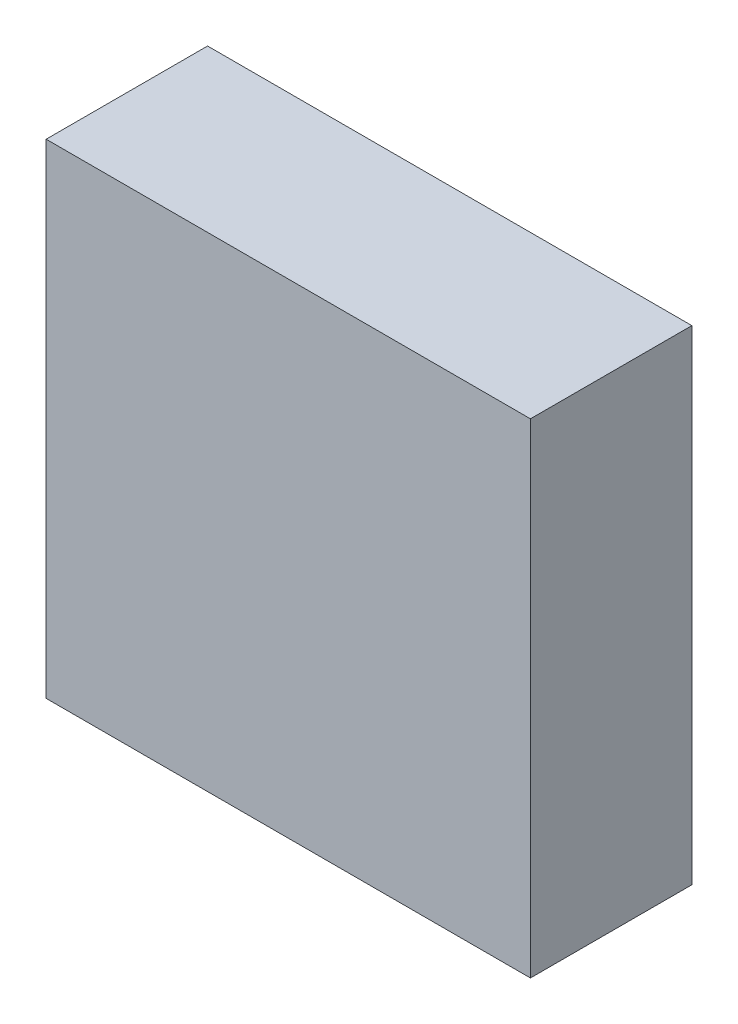
ISO-10303-21;
HEADER;
FILE_DESCRIPTION(('STEP AP214'),'2;1');
FILE_NAME('part.step','',(''),(''),'','','');
FILE_SCHEMA(('AUTOMOTIVE_DESIGN { 1 0 10303 214 1 1 1 1 }'));
ENDSEC;
DATA;
#1=APPLICATION_CONTEXT('core data for automotive mechanical design processes');
#2=APPLICATION_PROTOCOL_DEFINITION('international standard','automotive_design',2000,#1);
#3=PRODUCT_CONTEXT('',#1,'mechanical');
#4=PRODUCT('Part','Part','',(#3));
#5=PRODUCT_RELATED_PRODUCT_CATEGORY('part','',(#4));
#6=PRODUCT_DEFINITION_FORMATION('','',#4);
#7=PRODUCT_DEFINITION_CONTEXT('part definition',#1,'design');
#8=PRODUCT_DEFINITION('design','',#6,#7);
#9=PRODUCT_DEFINITION_SHAPE('','',#8);
#10=(LENGTH_UNIT() NAMED_UNIT(*) SI_UNIT(.MILLI.,.METRE.));
#11=(NAMED_UNIT(*) PLANE_ANGLE_UNIT() SI_UNIT($,.RADIAN.));
#12=(NAMED_UNIT(*) SI_UNIT($,.STERADIAN.) SOLID_ANGLE_UNIT());
#13=UNCERTAINTY_MEASURE_WITH_UNIT(LENGTH_MEASURE(1.E-05),#10,'distance_accuracy_value','');
#14=(GEOMETRIC_REPRESENTATION_CONTEXT(3) GLOBAL_UNCERTAINTY_ASSIGNED_CONTEXT((#13)) GLOBAL_UNIT_ASSIGNED_CONTEXT((#10,
#11,#12)) REPRESENTATION_CONTEXT('',''));
#15=CARTESIAN_POINT('',(0.,0.,0.));
#16=DIRECTION('',(0.,0.,1.));
#17=DIRECTION('',(1.,0.,0.));
#18=AXIS2_PLACEMENT_3D('',#15,#16,#17);
#19=CARTESIAN_POINT('',(0.,0.,1.));
#20=DIRECTION('',(1.,0.,0.));
#21=DIRECTION('',(0.,0.,-1.));
#22=AXIS2_PLACEMENT_3D('',#19,#20,#21);
#23=PLANE('',#22);
#24=DIRECTION('',(0.,-1.,0.));
#25=VECTOR('',#24,1.);
#26=CARTESIAN_POINT('',(0.,0.,0.));
#27=LINE('',#26,#25);
#28=CARTESIAN_POINT('',(0.,3.,0.));
#29=VERTEX_POINT('',#28);
#30=CARTESIAN_POINT('',(0.,0.,0.));
#31=VERTEX_POINT('',#30);
#32=EDGE_CURVE('E93',#29,#31,#27,.T.);
#33=ORIENTED_EDGE('',*,*,#32,.T.);
#34=DIRECTION('',(0.,0.,-1.));
#35=VECTOR('',#34,1.);
#36=CARTESIAN_POINT('',(0.,0.,1.));
#37=LINE('',#36,#35);
#38=CARTESIAN_POINT('',(0.,0.,1.));
#39=VERTEX_POINT('',#38);
#40=EDGE_CURVE('E11',#39,#31,#37,.T.);
#41=ORIENTED_EDGE('',*,*,#40,.F.);
#42=DIRECTION('',(0.,-1.,0.));
#43=VECTOR('',#42,1.);
#44=CARTESIAN_POINT('',(0.,0.,1.));
#45=LINE('',#44,#43);
#46=CARTESIAN_POINT('',(0.,3.,1.));
#47=VERTEX_POINT('',#46);
#48=EDGE_CURVE('E81',#47,#39,#45,.T.);
#49=ORIENTED_EDGE('',*,*,#48,.F.);
#50=DIRECTION('',(0.,0.,-1.));
#51=VECTOR('',#50,1.);
#52=CARTESIAN_POINT('',(0.,3.,1.));
#53=LINE('',#52,#51);
#54=EDGE_CURVE('E89',#47,#29,#53,.T.);
#55=ORIENTED_EDGE('',*,*,#54,.T.);
#56=EDGE_LOOP('',(#33,#41,#49,#55));
#57=FACE_BOUND('',#56,.T.);
#58=ADVANCED_FACE('F30',(#57),#23,.F.);
#59=CARTESIAN_POINT('',(0.,0.,1.));
#60=DIRECTION('',(0.,1.,0.));
#61=DIRECTION('',(0.,0.,1.));
#62=AXIS2_PLACEMENT_3D('',#59,#60,#61);
#63=PLANE('',#62);
#64=DIRECTION('',(1.,0.,0.));
#65=VECTOR('',#64,1.);
#66=CARTESIAN_POINT('',(0.,0.,0.));
#67=LINE('',#66,#65);
#68=CARTESIAN_POINT('',(3.,0.,0.));
#69=VERTEX_POINT('',#68);
#70=EDGE_CURVE('E85',#31,#69,#67,.T.);
#71=ORIENTED_EDGE('',*,*,#70,.T.);
#72=DIRECTION('',(0.,0.,-1.));
#73=VECTOR('',#72,1.);
#74=CARTESIAN_POINT('',(3.,0.,1.));
#75=LINE('',#74,#73);
#76=CARTESIAN_POINT('',(3.,0.,1.));
#77=VERTEX_POINT('',#76);
#78=EDGE_CURVE('E38',#77,#69,#75,.T.);
#79=ORIENTED_EDGE('',*,*,#78,.F.);
#80=DIRECTION('',(1.,0.,0.));
#81=VECTOR('',#80,1.);
#82=CARTESIAN_POINT('',(0.,0.,1.));
#83=LINE('',#82,#81);
#84=EDGE_CURVE('E76',#39,#77,#83,.T.);
#85=ORIENTED_EDGE('',*,*,#84,.F.);
#86=ORIENTED_EDGE('',*,*,#40,.T.);
#87=EDGE_LOOP('',(#71,#79,#85,#86));
#88=FACE_BOUND('',#87,.T.);
#89=ADVANCED_FACE('F84',(#88),#63,.F.);
#90=CARTESIAN_POINT('',(3.,0.,1.));
#91=DIRECTION('',(-1.,0.,0.));
#92=DIRECTION('',(0.,0.,1.));
#93=AXIS2_PLACEMENT_3D('',#90,#91,#92);
#94=PLANE('',#93);
#95=DIRECTION('',(0.,1.,0.));
#96=VECTOR('',#95,1.);
#97=CARTESIAN_POINT('',(3.,0.,0.));
#98=LINE('',#97,#96);
#99=CARTESIAN_POINT('',(3.,3.,0.));
#100=VERTEX_POINT('',#99);
#101=EDGE_CURVE('E63',#69,#100,#98,.T.);
#102=ORIENTED_EDGE('',*,*,#101,.T.);
#103=DIRECTION('',(0.,0.,-1.));
#104=VECTOR('',#103,1.);
#105=CARTESIAN_POINT('',(3.,3.,1.));
#106=LINE('',#105,#104);
#107=CARTESIAN_POINT('',(3.,3.,1.));
#108=VERTEX_POINT('',#107);
#109=EDGE_CURVE('E86',#108,#100,#106,.T.);
#110=ORIENTED_EDGE('',*,*,#109,.F.);
#111=DIRECTION('',(0.,1.,0.));
#112=VECTOR('',#111,1.);
#113=CARTESIAN_POINT('',(3.,0.,1.));
#114=LINE('',#113,#112);
#115=EDGE_CURVE('E79',#77,#108,#114,.T.);
#116=ORIENTED_EDGE('',*,*,#115,.F.);
#117=ORIENTED_EDGE('',*,*,#78,.T.);
#118=EDGE_LOOP('',(#102,#110,#116,#117));
#119=FACE_BOUND('',#118,.T.);
#120=ADVANCED_FACE('F87',(#119),#94,.F.);
#121=CARTESIAN_POINT('',(0.,3.,1.));
#122=DIRECTION('',(0.,-1.,0.));
#123=DIRECTION('',(0.,0.,-1.));
#124=AXIS2_PLACEMENT_3D('',#121,#122,#123);
#125=PLANE('',#124);
#126=DIRECTION('',(-1.,0.,0.));
#127=VECTOR('',#126,1.);
#128=CARTESIAN_POINT('',(0.,3.,0.));
#129=LINE('',#128,#127);
#130=EDGE_CURVE('E69',#100,#29,#129,.T.);
#131=ORIENTED_EDGE('',*,*,#130,.T.);
#132=ORIENTED_EDGE('',*,*,#54,.F.);
#133=DIRECTION('',(-1.,0.,0.));
#134=VECTOR('',#133,1.);
#135=CARTESIAN_POINT('',(0.,3.,1.));
#136=LINE('',#135,#134);
#137=EDGE_CURVE('E46',#108,#47,#136,.T.);
#138=ORIENTED_EDGE('',*,*,#137,.F.);
#139=ORIENTED_EDGE('',*,*,#109,.T.);
#140=EDGE_LOOP('',(#131,#132,#138,#139));
#141=FACE_BOUND('',#140,.T.);
#142=ADVANCED_FACE('F100',(#141),#125,.F.);
#143=CARTESIAN_POINT('',(0.,3.,1.));
#144=DIRECTION('',(0.,0.,-1.));
#145=DIRECTION('',(-1.,0.,0.));
#146=AXIS2_PLACEMENT_3D('',#143,#144,#145);
#147=PLANE('',#146);
#148=ORIENTED_EDGE('',*,*,#48,.T.);
#149=ORIENTED_EDGE('',*,*,#84,.T.);
#150=ORIENTED_EDGE('',*,*,#115,.T.);
#151=ORIENTED_EDGE('',*,*,#137,.T.);
#152=EDGE_LOOP('',(#148,#149,#150,#151));
#153=FACE_BOUND('',#152,.T.);
#154=ADVANCED_FACE('F77',(#153),#147,.F.);
#155=CARTESIAN_POINT('',(0.,3.,0.));
#156=DIRECTION('',(0.,0.,-1.));
#157=DIRECTION('',(-1.,0.,0.));
#158=AXIS2_PLACEMENT_3D('',#155,#156,#157);
#159=PLANE('',#158);
#160=ORIENTED_EDGE('',*,*,#32,.F.);
#161=ORIENTED_EDGE('',*,*,#130,.F.);
#162=ORIENTED_EDGE('',*,*,#101,.F.);
#163=ORIENTED_EDGE('',*,*,#70,.F.);
#164=EDGE_LOOP('',(#160,#161,#162,#163));
#165=FACE_BOUND('',#164,.T.);
#166=ADVANCED_FACE('F103',(#165),#159,.T.);
#167=CLOSED_SHELL('',(#58,#89,#120,#142,#154,#166));
#168=MANIFOLD_SOLID_BREP('B2',#167);
#169=ADVANCED_BREP_SHAPE_REPRESENTATION('',(#18,#168),#14);
#170=SHAPE_DEFINITION_REPRESENTATION(#9,#169);
ENDSEC;
END-ISO-10303-21;
